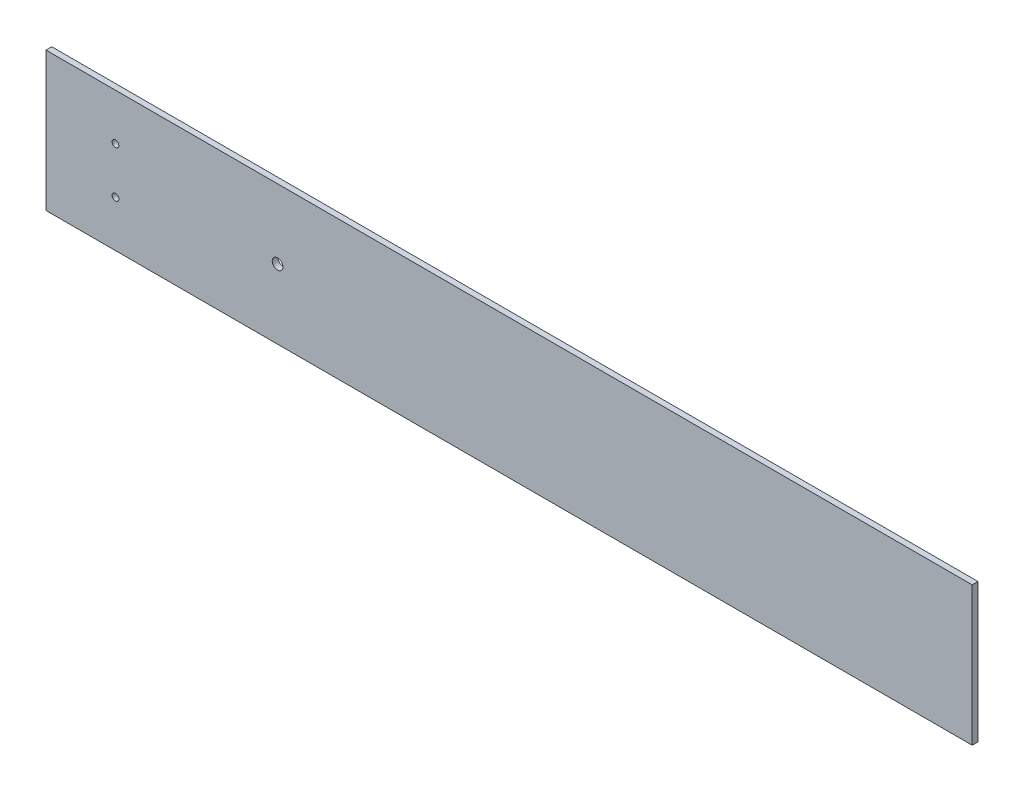
ISO-10303-21;
HEADER;
FILE_DESCRIPTION(('STEP AP214'),'2;1');
FILE_NAME('part.step','',(''),(''),'','','');
FILE_SCHEMA(('AUTOMOTIVE_DESIGN { 1 0 10303 214 1 1 1 1 }'));
ENDSEC;
DATA;
#1=APPLICATION_CONTEXT('core data for automotive mechanical design processes');
#2=APPLICATION_PROTOCOL_DEFINITION('international standard','automotive_design',2000,#1);
#3=PRODUCT_CONTEXT('',#1,'mechanical');
#4=PRODUCT('Part','Part','',(#3));
#5=PRODUCT_RELATED_PRODUCT_CATEGORY('part','',(#4));
#6=PRODUCT_DEFINITION_FORMATION('','',#4);
#7=PRODUCT_DEFINITION_CONTEXT('part definition',#1,'design');
#8=PRODUCT_DEFINITION('design','',#6,#7);
#9=PRODUCT_DEFINITION_SHAPE('','',#8);
#10=(LENGTH_UNIT() NAMED_UNIT(*) SI_UNIT(.MILLI.,.METRE.));
#11=(NAMED_UNIT(*) PLANE_ANGLE_UNIT() SI_UNIT($,.RADIAN.));
#12=(NAMED_UNIT(*) SI_UNIT($,.STERADIAN.) SOLID_ANGLE_UNIT());
#13=UNCERTAINTY_MEASURE_WITH_UNIT(LENGTH_MEASURE(1.E-05),#10,'distance_accuracy_value','');
#14=(GEOMETRIC_REPRESENTATION_CONTEXT(3) GLOBAL_UNCERTAINTY_ASSIGNED_CONTEXT((#13)) GLOBAL_UNIT_ASSIGNED_CONTEXT((#10,
#11,#12)) REPRESENTATION_CONTEXT('',''));
#15=CARTESIAN_POINT('',(0.,0.,0.));
#16=DIRECTION('',(0.,0.,1.));
#17=DIRECTION('',(1.,0.,0.));
#18=AXIS2_PLACEMENT_3D('',#15,#16,#17);
#19=CARTESIAN_POINT('',(0.,0.,3.175));
#20=DIRECTION('',(1.,0.,0.));
#21=DIRECTION('',(0.,0.,-1.));
#22=AXIS2_PLACEMENT_3D('',#19,#20,#21);
#23=PLANE('',#22);
#24=DIRECTION('',(0.,-1.,0.));
#25=VECTOR('',#24,1.);
#26=CARTESIAN_POINT('',(0.,0.,0.));
#27=LINE('',#26,#25);
#28=CARTESIAN_POINT('',(0.,76.2,0.));
#29=VERTEX_POINT('',#28);
#30=CARTESIAN_POINT('',(0.,0.,0.));
#31=VERTEX_POINT('',#30);
#32=EDGE_CURVE('E96',#29,#31,#27,.T.);
#33=ORIENTED_EDGE('',*,*,#32,.T.);
#34=DIRECTION('',(0.,0.,-1.));
#35=VECTOR('',#34,1.);
#36=CARTESIAN_POINT('',(0.,0.,3.175));
#37=LINE('',#36,#35);
#38=CARTESIAN_POINT('',(0.,0.,3.175));
#39=VERTEX_POINT('',#38);
#40=EDGE_CURVE('E11',#39,#31,#37,.T.);
#41=ORIENTED_EDGE('',*,*,#40,.F.);
#42=DIRECTION('',(0.,-1.,0.));
#43=VECTOR('',#42,1.);
#44=CARTESIAN_POINT('',(0.,0.,3.175));
#45=LINE('',#44,#43);
#46=CARTESIAN_POINT('',(0.,76.2,3.175));
#47=VERTEX_POINT('',#46);
#48=EDGE_CURVE('E84',#47,#39,#45,.T.);
#49=ORIENTED_EDGE('',*,*,#48,.F.);
#50=DIRECTION('',(0.,0.,-1.));
#51=VECTOR('',#50,1.);
#52=CARTESIAN_POINT('',(0.,76.2,3.175));
#53=LINE('',#52,#51);
#54=EDGE_CURVE('E92',#47,#29,#53,.T.);
#55=ORIENTED_EDGE('',*,*,#54,.T.);
#56=EDGE_LOOP('',(#33,#41,#49,#55));
#57=FACE_BOUND('',#56,.T.);
#58=ADVANCED_FACE('F33',(#57),#23,.F.);
#59=CARTESIAN_POINT('',(0.,0.,3.175));
#60=DIRECTION('',(0.,1.,0.));
#61=DIRECTION('',(0.,0.,1.));
#62=AXIS2_PLACEMENT_3D('',#59,#60,#61);
#63=PLANE('',#62);
#64=DIRECTION('',(1.,0.,0.));
#65=VECTOR('',#64,1.);
#66=CARTESIAN_POINT('',(0.,0.,0.));
#67=LINE('',#66,#65);
#68=CARTESIAN_POINT('',(508.,0.,0.));
#69=VERTEX_POINT('',#68);
#70=EDGE_CURVE('E88',#31,#69,#67,.T.);
#71=ORIENTED_EDGE('',*,*,#70,.T.);
#72=DIRECTION('',(0.,0.,-1.));
#73=VECTOR('',#72,1.);
#74=CARTESIAN_POINT('',(508.,0.,3.175));
#75=LINE('',#74,#73);
#76=CARTESIAN_POINT('',(508.,0.,3.175));
#77=VERTEX_POINT('',#76);
#78=EDGE_CURVE('E41',#77,#69,#75,.T.);
#79=ORIENTED_EDGE('',*,*,#78,.F.);
#80=DIRECTION('',(1.,0.,0.));
#81=VECTOR('',#80,1.);
#82=CARTESIAN_POINT('',(0.,0.,3.175));
#83=LINE('',#82,#81);
#84=EDGE_CURVE('E79',#39,#77,#83,.T.);
#85=ORIENTED_EDGE('',*,*,#84,.F.);
#86=ORIENTED_EDGE('',*,*,#40,.T.);
#87=EDGE_LOOP('',(#71,#79,#85,#86));
#88=FACE_BOUND('',#87,.T.);
#89=ADVANCED_FACE('F87',(#88),#63,.F.);
#90=CARTESIAN_POINT('',(508.,0.,3.175));
#91=DIRECTION('',(-1.,0.,0.));
#92=DIRECTION('',(0.,0.,1.));
#93=AXIS2_PLACEMENT_3D('',#90,#91,#92);
#94=PLANE('',#93);
#95=DIRECTION('',(0.,1.,0.));
#96=VECTOR('',#95,1.);
#97=CARTESIAN_POINT('',(508.,0.,0.));
#98=LINE('',#97,#96);
#99=CARTESIAN_POINT('',(508.,76.2,0.));
#100=VERTEX_POINT('',#99);
#101=EDGE_CURVE('E66',#69,#100,#98,.T.);
#102=ORIENTED_EDGE('',*,*,#101,.T.);
#103=DIRECTION('',(0.,0.,-1.));
#104=VECTOR('',#103,1.);
#105=CARTESIAN_POINT('',(508.,76.2,3.175));
#106=LINE('',#105,#104);
#107=CARTESIAN_POINT('',(508.,76.2,3.175));
#108=VERTEX_POINT('',#107);
#109=EDGE_CURVE('E89',#108,#100,#106,.T.);
#110=ORIENTED_EDGE('',*,*,#109,.F.);
#111=DIRECTION('',(0.,1.,0.));
#112=VECTOR('',#111,1.);
#113=CARTESIAN_POINT('',(508.,0.,3.175));
#114=LINE('',#113,#112);
#115=EDGE_CURVE('E82',#77,#108,#114,.T.);
#116=ORIENTED_EDGE('',*,*,#115,.F.);
#117=ORIENTED_EDGE('',*,*,#78,.T.);
#118=EDGE_LOOP('',(#102,#110,#116,#117));
#119=FACE_BOUND('',#118,.T.);
#120=ADVANCED_FACE('F90',(#119),#94,.F.);
#121=CARTESIAN_POINT('',(0.,76.2,3.175));
#122=DIRECTION('',(0.,-1.,0.));
#123=DIRECTION('',(0.,0.,-1.));
#124=AXIS2_PLACEMENT_3D('',#121,#122,#123);
#125=PLANE('',#124);
#126=DIRECTION('',(-1.,0.,0.));
#127=VECTOR('',#126,1.);
#128=CARTESIAN_POINT('',(0.,76.2,0.));
#129=LINE('',#128,#127);
#130=EDGE_CURVE('E72',#100,#29,#129,.T.);
#131=ORIENTED_EDGE('',*,*,#130,.T.);
#132=ORIENTED_EDGE('',*,*,#54,.F.);
#133=DIRECTION('',(-1.,0.,0.));
#134=VECTOR('',#133,1.);
#135=CARTESIAN_POINT('',(0.,76.2,3.175));
#136=LINE('',#135,#134);
#137=EDGE_CURVE('E49',#108,#47,#136,.T.);
#138=ORIENTED_EDGE('',*,*,#137,.F.);
#139=ORIENTED_EDGE('',*,*,#109,.T.);
#140=EDGE_LOOP('',(#131,#132,#138,#139));
#141=FACE_BOUND('',#140,.T.);
#142=ADVANCED_FACE('F104',(#141),#125,.F.);
#143=CARTESIAN_POINT('',(0.,76.2,3.175));
#144=DIRECTION('',(0.,0.,-1.));
#145=DIRECTION('',(-1.,0.,0.));
#146=AXIS2_PLACEMENT_3D('',#143,#144,#145);
#147=PLANE('',#146);
#148=CARTESIAN_POINT('',(127.,38.1,3.175));
#149=DIRECTION('',(0.,0.,1.));
#150=DIRECTION('',(1.,0.,0.));
#151=AXIS2_PLACEMENT_3D('',#148,#149,#150);
#152=CIRCLE('',#151,2.921);
#153=CARTESIAN_POINT('',(129.921,38.1,3.175));
#154=VERTEX_POINT('',#153);
#155=EDGE_CURVE('E122',#154,#154,#152,.T.);
#156=ORIENTED_EDGE('',*,*,#155,.F.);
#157=EDGE_LOOP('',(#156));
#158=FACE_BOUND('',#157,.T.);
#159=CARTESIAN_POINT('',(38.1,25.4,3.175));
#160=DIRECTION('',(0.,0.,1.));
#161=DIRECTION('',(-1.,0.,0.));
#162=AXIS2_PLACEMENT_3D('',#159,#160,#161);
#163=CIRCLE('',#162,1.84149999999999);
#164=CARTESIAN_POINT('',(36.2585,25.4,3.175));
#165=VERTEX_POINT('',#164);
#166=EDGE_CURVE('E116',#165,#165,#163,.T.);
#167=ORIENTED_EDGE('',*,*,#166,.F.);
#168=EDGE_LOOP('',(#167));
#169=FACE_BOUND('',#168,.T.);
#170=CARTESIAN_POINT('',(38.1,50.8,3.175));
#171=DIRECTION('',(0.,0.,1.));
#172=DIRECTION('',(1.,0.,0.));
#173=AXIS2_PLACEMENT_3D('',#170,#171,#172);
#174=CIRCLE('',#173,1.84149999999999);
#175=CARTESIAN_POINT('',(39.9415,50.8,3.175));
#176=VERTEX_POINT('',#175);
#177=EDGE_CURVE('E110',#176,#176,#174,.T.);
#178=ORIENTED_EDGE('',*,*,#177,.F.);
#179=EDGE_LOOP('',(#178));
#180=FACE_BOUND('',#179,.T.);
#181=ORIENTED_EDGE('',*,*,#48,.T.);
#182=ORIENTED_EDGE('',*,*,#84,.T.);
#183=ORIENTED_EDGE('',*,*,#115,.T.);
#184=ORIENTED_EDGE('',*,*,#137,.T.);
#185=EDGE_LOOP('',(#181,#182,#183,#184));
#186=FACE_BOUND('',#185,.T.);
#187=ADVANCED_FACE('F80',(#158,#169,#180,#186),#147,.F.);
#188=CARTESIAN_POINT('',(0.,76.2,0.));
#189=DIRECTION('',(0.,0.,-1.));
#190=DIRECTION('',(-1.,0.,0.));
#191=AXIS2_PLACEMENT_3D('',#188,#189,#190);
#192=PLANE('',#191);
#193=CARTESIAN_POINT('',(127.,38.1,0.));
#194=DIRECTION('',(0.,0.,1.));
#195=DIRECTION('',(1.,0.,0.));
#196=AXIS2_PLACEMENT_3D('',#193,#194,#195);
#197=CIRCLE('',#196,2.921);
#198=CARTESIAN_POINT('',(129.921,38.1,0.));
#199=VERTEX_POINT('',#198);
#200=EDGE_CURVE('E119',#199,#199,#197,.T.);
#201=ORIENTED_EDGE('',*,*,#200,.T.);
#202=EDGE_LOOP('',(#201));
#203=FACE_BOUND('',#202,.T.);
#204=CARTESIAN_POINT('',(38.1,25.4,0.));
#205=DIRECTION('',(0.,0.,1.));
#206=DIRECTION('',(-1.,0.,0.));
#207=AXIS2_PLACEMENT_3D('',#204,#205,#206);
#208=CIRCLE('',#207,1.84149999999999);
#209=CARTESIAN_POINT('',(36.2585,25.4,0.));
#210=VERTEX_POINT('',#209);
#211=EDGE_CURVE('E113',#210,#210,#208,.T.);
#212=ORIENTED_EDGE('',*,*,#211,.T.);
#213=EDGE_LOOP('',(#212));
#214=FACE_BOUND('',#213,.T.);
#215=CARTESIAN_POINT('',(38.1,50.8,0.));
#216=DIRECTION('',(0.,0.,1.));
#217=DIRECTION('',(1.,0.,0.));
#218=AXIS2_PLACEMENT_3D('',#215,#216,#217);
#219=CIRCLE('',#218,1.84149999999999);
#220=CARTESIAN_POINT('',(39.9415,50.8,0.));
#221=VERTEX_POINT('',#220);
#222=EDGE_CURVE('E99',#221,#221,#219,.T.);
#223=ORIENTED_EDGE('',*,*,#222,.T.);
#224=EDGE_LOOP('',(#223));
#225=FACE_BOUND('',#224,.T.);
#226=ORIENTED_EDGE('',*,*,#32,.F.);
#227=ORIENTED_EDGE('',*,*,#130,.F.);
#228=ORIENTED_EDGE('',*,*,#101,.F.);
#229=ORIENTED_EDGE('',*,*,#70,.F.);
#230=EDGE_LOOP('',(#226,#227,#228,#229));
#231=FACE_BOUND('',#230,.T.);
#232=ADVANCED_FACE('F107',(#203,#214,#225,#231),#192,.T.);
#233=CARTESIAN_POINT('',(38.1,50.8,0.));
#234=DIRECTION('',(0.,0.,1.));
#235=DIRECTION('',(1.,0.,0.));
#236=AXIS2_PLACEMENT_3D('',#233,#234,#235);
#237=CYLINDRICAL_SURFACE('',#236,1.84149999999999);
#238=ORIENTED_EDGE('',*,*,#222,.F.);
#239=EDGE_LOOP('',(#238));
#240=FACE_BOUND('',#239,.T.);
#241=ORIENTED_EDGE('',*,*,#177,.T.);
#242=EDGE_LOOP('',(#241));
#243=FACE_BOUND('',#242,.T.);
#244=ADVANCED_FACE('F144',(#240,#243),#237,.F.);
#245=CARTESIAN_POINT('',(38.1,25.4,0.));
#246=DIRECTION('',(0.,0.,1.));
#247=DIRECTION('',(1.,0.,0.));
#248=AXIS2_PLACEMENT_3D('',#245,#246,#247);
#249=CYLINDRICAL_SURFACE('',#248,1.84149999999999);
#250=ORIENTED_EDGE('',*,*,#211,.F.);
#251=EDGE_LOOP('',(#250));
#252=FACE_BOUND('',#251,.T.);
#253=ORIENTED_EDGE('',*,*,#166,.T.);
#254=EDGE_LOOP('',(#253));
#255=FACE_BOUND('',#254,.T.);
#256=ADVANCED_FACE('F133',(#252,#255),#249,.F.);
#257=CARTESIAN_POINT('',(127.,38.1,0.));
#258=DIRECTION('',(0.,0.,1.));
#259=DIRECTION('',(1.,0.,0.));
#260=AXIS2_PLACEMENT_3D('',#257,#258,#259);
#261=CYLINDRICAL_SURFACE('',#260,2.921);
#262=ORIENTED_EDGE('',*,*,#200,.F.);
#263=EDGE_LOOP('',(#262));
#264=FACE_BOUND('',#263,.T.);
#265=ORIENTED_EDGE('',*,*,#155,.T.);
#266=EDGE_LOOP('',(#265));
#267=FACE_BOUND('',#266,.T.);
#268=ADVANCED_FACE('F130',(#264,#267),#261,.F.);
#269=CLOSED_SHELL('',(#58,#89,#120,#142,#187,#232,#244,#256,#268));
#270=MANIFOLD_SOLID_BREP('B2',#269);
#271=ADVANCED_BREP_SHAPE_REPRESENTATION('',(#18,#270),#14);
#272=SHAPE_DEFINITION_REPRESENTATION(#9,#271);
ENDSEC;
END-ISO-10303-21;
